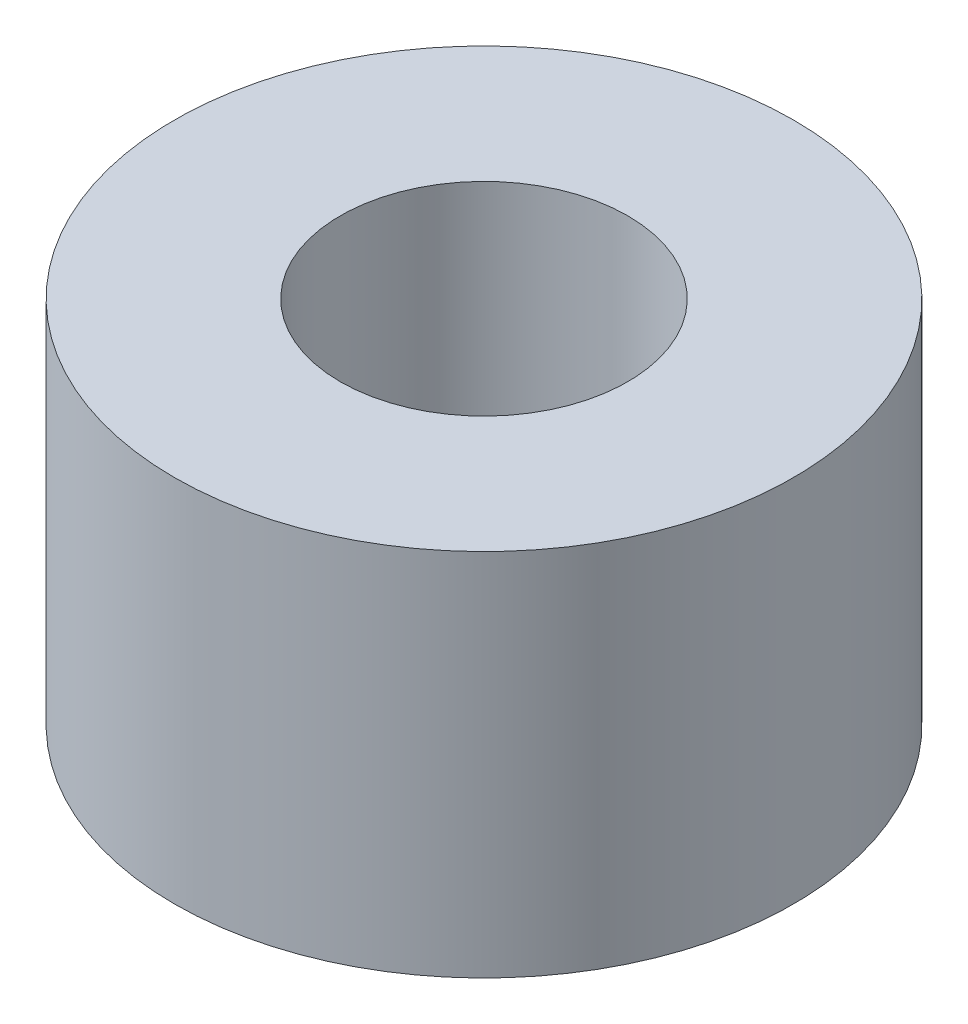
ISO-10303-21;
HEADER;
FILE_DESCRIPTION(('STEP AP214'),'2;1');
FILE_NAME('part.step','',(''),(''),'','','');
FILE_SCHEMA(('AUTOMOTIVE_DESIGN { 1 0 10303 214 1 1 1 1 }'));
ENDSEC;
DATA;
#1=APPLICATION_CONTEXT('core data for automotive mechanical design processes');
#2=APPLICATION_PROTOCOL_DEFINITION('international standard','automotive_design',2000,#1);
#3=PRODUCT_CONTEXT('',#1,'mechanical');
#4=PRODUCT('Part','Part','',(#3));
#5=PRODUCT_RELATED_PRODUCT_CATEGORY('part','',(#4));
#6=PRODUCT_DEFINITION_FORMATION('','',#4);
#7=PRODUCT_DEFINITION_CONTEXT('part definition',#1,'design');
#8=PRODUCT_DEFINITION('design','',#6,#7);
#9=PRODUCT_DEFINITION_SHAPE('','',#8);
#10=(LENGTH_UNIT() NAMED_UNIT(*) SI_UNIT(.MILLI.,.METRE.));
#11=(NAMED_UNIT(*) PLANE_ANGLE_UNIT() SI_UNIT($,.RADIAN.));
#12=(NAMED_UNIT(*) SI_UNIT($,.STERADIAN.) SOLID_ANGLE_UNIT());
#13=UNCERTAINTY_MEASURE_WITH_UNIT(LENGTH_MEASURE(1.E-05),#10,'distance_accuracy_value','');
#14=(GEOMETRIC_REPRESENTATION_CONTEXT(3) GLOBAL_UNCERTAINTY_ASSIGNED_CONTEXT((#13)) GLOBAL_UNIT_ASSIGNED_CONTEXT((#10,
#11,#12)) REPRESENTATION_CONTEXT('',''));
#15=CARTESIAN_POINT('',(0.,0.,0.));
#16=DIRECTION('',(0.,0.,1.));
#17=DIRECTION('',(1.,0.,0.));
#18=AXIS2_PLACEMENT_3D('',#15,#16,#17);
#19=CARTESIAN_POINT('',(0.,2.0875,0.));
#20=DIRECTION('',(0.,1.,0.));
#21=DIRECTION('',(0.,0.,1.));
#22=AXIS2_PLACEMENT_3D('',#19,#20,#21);
#23=PLANE('',#22);
#24=CARTESIAN_POINT('',(0.,2.0875,0.));
#25=DIRECTION('',(0.,1.,0.));
#26=DIRECTION('',(0.,0.,1.));
#27=AXIS2_PLACEMENT_3D('',#24,#25,#26);
#28=CIRCLE('',#27,3.5);
#29=CARTESIAN_POINT('',(0.,2.0875,3.5));
#30=VERTEX_POINT('',#29);
#31=EDGE_CURVE('E10',#30,#30,#28,.T.);
#32=ORIENTED_EDGE('',*,*,#31,.T.);
#33=EDGE_LOOP('',(#32));
#34=FACE_BOUND('',#33,.T.);
#35=CARTESIAN_POINT('',(0.,2.0875,0.));
#36=DIRECTION('',(0.,1.,0.));
#37=DIRECTION('',(0.,0.,1.));
#38=AXIS2_PLACEMENT_3D('',#35,#36,#37);
#39=CIRCLE('',#38,1.625);
#40=CARTESIAN_POINT('',(0.,2.0875,1.625));
#41=VERTEX_POINT('',#40);
#42=EDGE_CURVE('E50',#41,#41,#39,.T.);
#43=ORIENTED_EDGE('',*,*,#42,.F.);
#44=EDGE_LOOP('',(#43));
#45=FACE_BOUND('',#44,.T.);
#46=ADVANCED_FACE('F37',(#34,#45),#23,.T.);
#47=CARTESIAN_POINT('',(0.,-2.0875,0.));
#48=DIRECTION('',(0.,1.,0.));
#49=DIRECTION('',(0.,0.,1.));
#50=AXIS2_PLACEMENT_3D('',#47,#48,#49);
#51=PLANE('',#50);
#52=CARTESIAN_POINT('',(0.,-2.0875,0.));
#53=DIRECTION('',(0.,1.,0.));
#54=DIRECTION('',(0.,0.,1.));
#55=AXIS2_PLACEMENT_3D('',#52,#53,#54);
#56=CIRCLE('',#55,3.5);
#57=CARTESIAN_POINT('',(0.,-2.0875,3.5));
#58=VERTEX_POINT('',#57);
#59=EDGE_CURVE('E41',#58,#58,#56,.T.);
#60=ORIENTED_EDGE('',*,*,#59,.F.);
#61=EDGE_LOOP('',(#60));
#62=FACE_BOUND('',#61,.T.);
#63=CARTESIAN_POINT('',(0.,-2.0875,0.));
#64=DIRECTION('',(0.,1.,0.));
#65=DIRECTION('',(0.,0.,1.));
#66=AXIS2_PLACEMENT_3D('',#63,#64,#65);
#67=CIRCLE('',#66,1.625);
#68=CARTESIAN_POINT('',(0.,-2.0875,1.625));
#69=VERTEX_POINT('',#68);
#70=EDGE_CURVE('E52',#69,#69,#67,.T.);
#71=ORIENTED_EDGE('',*,*,#70,.T.);
#72=EDGE_LOOP('',(#71));
#73=FACE_BOUND('',#72,.T.);
#74=ADVANCED_FACE('F64',(#62,#73),#51,.F.);
#75=CARTESIAN_POINT('',(0.,2.0875,0.));
#76=DIRECTION('',(0.,-1.,0.));
#77=DIRECTION('',(0.,0.,-1.));
#78=AXIS2_PLACEMENT_3D('',#75,#76,#77);
#79=CYLINDRICAL_SURFACE('',#78,3.5);
#80=ORIENTED_EDGE('',*,*,#31,.F.);
#81=EDGE_LOOP('',(#80));
#82=FACE_BOUND('',#81,.T.);
#83=ORIENTED_EDGE('',*,*,#59,.T.);
#84=EDGE_LOOP('',(#83));
#85=FACE_BOUND('',#84,.T.);
#86=ADVANCED_FACE('F39',(#82,#85),#79,.T.);
#87=CARTESIAN_POINT('',(0.,2.0875,0.));
#88=DIRECTION('',(0.,-1.,0.));
#89=DIRECTION('',(0.,0.,-1.));
#90=AXIS2_PLACEMENT_3D('',#87,#88,#89);
#91=CYLINDRICAL_SURFACE('',#90,1.625);
#92=ORIENTED_EDGE('',*,*,#42,.T.);
#93=EDGE_LOOP('',(#92));
#94=FACE_BOUND('',#93,.T.);
#95=ORIENTED_EDGE('',*,*,#70,.F.);
#96=EDGE_LOOP('',(#95));
#97=FACE_BOUND('',#96,.T.);
#98=ADVANCED_FACE('F60',(#94,#97),#91,.F.);
#99=CLOSED_SHELL('',(#46,#74,#86,#98));
#100=MANIFOLD_SOLID_BREP('B2',#99);
#101=ADVANCED_BREP_SHAPE_REPRESENTATION('',(#18,#100),#14);
#102=SHAPE_DEFINITION_REPRESENTATION(#9,#101);
ENDSEC;
END-ISO-10303-21;
